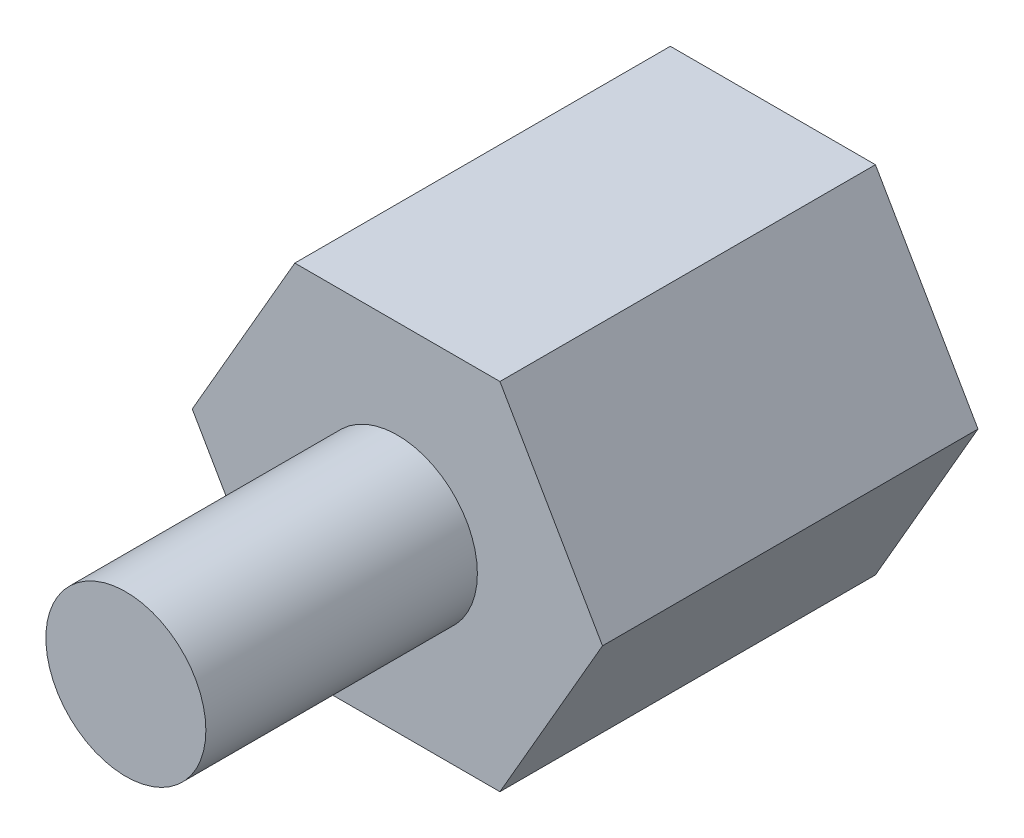
ISO-10303-21;
HEADER;
FILE_DESCRIPTION(('STEP AP214'),'2;1');
FILE_NAME('part.step','',(''),(''),'','','');
FILE_SCHEMA(('AUTOMOTIVE_DESIGN { 1 0 10303 214 1 1 1 1 }'));
ENDSEC;
DATA;
#1=APPLICATION_CONTEXT('core data for automotive mechanical design processes');
#2=APPLICATION_PROTOCOL_DEFINITION('international standard','automotive_design',2000,#1);
#3=PRODUCT_CONTEXT('',#1,'mechanical');
#4=PRODUCT('Part','Part','',(#3));
#5=PRODUCT_RELATED_PRODUCT_CATEGORY('part','',(#4));
#6=PRODUCT_DEFINITION_FORMATION('','',#4);
#7=PRODUCT_DEFINITION_CONTEXT('part definition',#1,'design');
#8=PRODUCT_DEFINITION('design','',#6,#7);
#9=PRODUCT_DEFINITION_SHAPE('','',#8);
#10=(LENGTH_UNIT() NAMED_UNIT(*) SI_UNIT(.MILLI.,.METRE.));
#11=(NAMED_UNIT(*) PLANE_ANGLE_UNIT() SI_UNIT($,.RADIAN.));
#12=(NAMED_UNIT(*) SI_UNIT($,.STERADIAN.) SOLID_ANGLE_UNIT());
#13=UNCERTAINTY_MEASURE_WITH_UNIT(LENGTH_MEASURE(1.E-05),#10,'distance_accuracy_value','');
#14=(GEOMETRIC_REPRESENTATION_CONTEXT(3) GLOBAL_UNCERTAINTY_ASSIGNED_CONTEXT((#13)) GLOBAL_UNIT_ASSIGNED_CONTEXT((#10,
#11,#12)) REPRESENTATION_CONTEXT('',''));
#15=CARTESIAN_POINT('',(0.,0.,0.));
#16=DIRECTION('',(0.,0.,1.));
#17=DIRECTION('',(1.,0.,0.));
#18=AXIS2_PLACEMENT_3D('',#15,#16,#17);
#19=CARTESIAN_POINT('',(0.,0.,6.5));
#20=DIRECTION('',(0.,0.,1.));
#21=DIRECTION('',(1.,0.,0.));
#22=AXIS2_PLACEMENT_3D('',#19,#20,#21);
#23=PLANE('',#22);
#24=DIRECTION('',(0.5,0.866025403784439,0.));
#25=VECTOR('',#24,1.);
#26=CARTESIAN_POINT('',(1.7753520777581,-3.075,6.5));
#27=LINE('',#26,#25);
#28=CARTESIAN_POINT('',(1.7753520777581,-3.075,6.5));
#29=VERTEX_POINT('',#28);
#30=CARTESIAN_POINT('',(3.5507041555162,0.,6.5));
#31=VERTEX_POINT('',#30);
#32=EDGE_CURVE('E160',#29,#31,#27,.T.);
#33=ORIENTED_EDGE('',*,*,#32,.T.);
#34=DIRECTION('',(-0.5,0.866025403784439,0.));
#35=VECTOR('',#34,1.);
#36=CARTESIAN_POINT('',(3.5507041555162,0.,6.5));
#37=LINE('',#36,#35);
#38=CARTESIAN_POINT('',(1.77535207775809,3.07500000000001,6.5));
#39=VERTEX_POINT('',#38);
#40=EDGE_CURVE('E106',#31,#39,#37,.T.);
#41=ORIENTED_EDGE('',*,*,#40,.T.);
#42=DIRECTION('',(-1.,0.,0.));
#43=VECTOR('',#42,1.);
#44=CARTESIAN_POINT('',(1.77535207775809,3.07500000000001,6.5));
#45=LINE('',#44,#43);
#46=CARTESIAN_POINT('',(-1.7753520777581,3.07500000000001,6.5));
#47=VERTEX_POINT('',#46);
#48=EDGE_CURVE('E121',#39,#47,#45,.T.);
#49=ORIENTED_EDGE('',*,*,#48,.T.);
#50=DIRECTION('',(-0.5,-0.866025403784439,0.));
#51=VECTOR('',#50,1.);
#52=CARTESIAN_POINT('',(-1.7753520777581,3.07500000000001,6.5));
#53=LINE('',#52,#51);
#54=CARTESIAN_POINT('',(-3.5507041555162,0.,6.5));
#55=VERTEX_POINT('',#54);
#56=EDGE_CURVE('E115',#47,#55,#53,.T.);
#57=ORIENTED_EDGE('',*,*,#56,.T.);
#58=DIRECTION('',(0.499999999999999,-0.866025403784439,0.));
#59=VECTOR('',#58,1.);
#60=CARTESIAN_POINT('',(-3.5507041555162,0.,6.5));
#61=LINE('',#60,#59);
#62=CARTESIAN_POINT('',(-1.7753520777581,-3.075,6.5));
#63=VERTEX_POINT('',#62);
#64=EDGE_CURVE('E119',#55,#63,#61,.T.);
#65=ORIENTED_EDGE('',*,*,#64,.T.);
#66=DIRECTION('',(1.,0.,0.));
#67=VECTOR('',#66,1.);
#68=CARTESIAN_POINT('',(-1.7753520777581,-3.075,6.5));
#69=LINE('',#68,#67);
#70=EDGE_CURVE('E61',#63,#29,#69,.T.);
#71=ORIENTED_EDGE('',*,*,#70,.T.);
#72=EDGE_LOOP('',(#33,#41,#49,#57,#65,#71));
#73=FACE_BOUND('',#72,.T.);
#74=CARTESIAN_POINT('',(0.,0.,6.5));
#75=DIRECTION('',(0.,0.,1.));
#76=DIRECTION('',(1.,0.,0.));
#77=AXIS2_PLACEMENT_3D('',#74,#75,#76);
#78=CIRCLE('',#77,1.385);
#79=CARTESIAN_POINT('',(1.385,0.,6.5));
#80=VERTEX_POINT('',#79);
#81=EDGE_CURVE('E216',#80,#80,#78,.T.);
#82=ORIENTED_EDGE('',*,*,#81,.F.);
#83=EDGE_LOOP('',(#82));
#84=FACE_BOUND('',#83,.T.);
#85=ADVANCED_FACE('F41',(#73,#84),#23,.T.);
#86=CARTESIAN_POINT('',(1.7753520777581,-3.075,6.5));
#87=DIRECTION('',(-0.866025403784439,0.5,0.));
#88=DIRECTION('',(-0.5,-0.866025403784439,0.));
#89=AXIS2_PLACEMENT_3D('',#86,#87,#88);
#90=PLANE('',#89);
#91=DIRECTION('',(0.5,0.866025403784439,0.));
#92=VECTOR('',#91,1.);
#93=CARTESIAN_POINT('',(1.7753520777581,-3.075,0.));
#94=LINE('',#93,#92);
#95=CARTESIAN_POINT('',(1.7753520777581,-3.075,0.));
#96=VERTEX_POINT('',#95);
#97=CARTESIAN_POINT('',(3.5507041555162,0.,0.));
#98=VERTEX_POINT('',#97);
#99=EDGE_CURVE('E144',#96,#98,#94,.T.);
#100=ORIENTED_EDGE('',*,*,#99,.T.);
#101=DIRECTION('',(0.,0.,-1.));
#102=VECTOR('',#101,1.);
#103=CARTESIAN_POINT('',(3.5507041555162,0.,6.5));
#104=LINE('',#103,#102);
#105=EDGE_CURVE('E11',#31,#98,#104,.T.);
#106=ORIENTED_EDGE('',*,*,#105,.F.);
#107=ORIENTED_EDGE('',*,*,#32,.F.);
#108=DIRECTION('',(0.,0.,-1.));
#109=VECTOR('',#108,1.);
#110=CARTESIAN_POINT('',(1.7753520777581,-3.075,6.5));
#111=LINE('',#110,#109);
#112=EDGE_CURVE('E140',#29,#96,#111,.T.);
#113=ORIENTED_EDGE('',*,*,#112,.T.);
#114=EDGE_LOOP('',(#100,#106,#107,#113));
#115=FACE_BOUND('',#114,.T.);
#116=ADVANCED_FACE('F43',(#115),#90,.F.);
#117=CARTESIAN_POINT('',(3.5507041555162,0.,6.5));
#118=DIRECTION('',(-0.866025403784439,-0.5,0.));
#119=DIRECTION('',(0.5,-0.866025403784439,0.));
#120=AXIS2_PLACEMENT_3D('',#117,#118,#119);
#121=PLANE('',#120);
#122=DIRECTION('',(-0.5,0.866025403784439,0.));
#123=VECTOR('',#122,1.);
#124=CARTESIAN_POINT('',(3.5507041555162,0.,0.));
#125=LINE('',#124,#123);
#126=CARTESIAN_POINT('',(1.77535207775809,3.07500000000001,0.));
#127=VERTEX_POINT('',#126);
#128=EDGE_CURVE('E147',#98,#127,#125,.T.);
#129=ORIENTED_EDGE('',*,*,#128,.T.);
#130=DIRECTION('',(0.,0.,-1.));
#131=VECTOR('',#130,1.);
#132=CARTESIAN_POINT('',(1.77535207775809,3.07500000000001,6.5));
#133=LINE('',#132,#131);
#134=EDGE_CURVE('E51',#39,#127,#133,.T.);
#135=ORIENTED_EDGE('',*,*,#134,.F.);
#136=ORIENTED_EDGE('',*,*,#40,.F.);
#137=ORIENTED_EDGE('',*,*,#105,.T.);
#138=EDGE_LOOP('',(#129,#135,#136,#137));
#139=FACE_BOUND('',#138,.T.);
#140=ADVANCED_FACE('F194',(#139),#121,.F.);
#141=CARTESIAN_POINT('',(1.77535207775809,3.07500000000001,6.5));
#142=DIRECTION('',(0.,-1.,0.));
#143=DIRECTION('',(1.,0.,0.));
#144=AXIS2_PLACEMENT_3D('',#141,#142,#143);
#145=PLANE('',#144);
#146=DIRECTION('',(-1.,0.,0.));
#147=VECTOR('',#146,1.);
#148=CARTESIAN_POINT('',(1.77535207775809,3.07500000000001,0.));
#149=LINE('',#148,#147);
#150=CARTESIAN_POINT('',(-1.7753520777581,3.07500000000001,0.));
#151=VERTEX_POINT('',#150);
#152=EDGE_CURVE('E151',#127,#151,#149,.T.);
#153=ORIENTED_EDGE('',*,*,#152,.T.);
#154=DIRECTION('',(0.,0.,-1.));
#155=VECTOR('',#154,1.);
#156=CARTESIAN_POINT('',(-1.7753520777581,3.07500000000001,6.5));
#157=LINE('',#156,#155);
#158=EDGE_CURVE('E132',#47,#151,#157,.T.);
#159=ORIENTED_EDGE('',*,*,#158,.F.);
#160=ORIENTED_EDGE('',*,*,#48,.F.);
#161=ORIENTED_EDGE('',*,*,#134,.T.);
#162=EDGE_LOOP('',(#153,#159,#160,#161));
#163=FACE_BOUND('',#162,.T.);
#164=ADVANCED_FACE('F171',(#163),#145,.F.);
#165=CARTESIAN_POINT('',(-1.7753520777581,3.07500000000001,6.5));
#166=DIRECTION('',(0.866025403784439,-0.5,0.));
#167=DIRECTION('',(0.5,0.866025403784439,0.));
#168=AXIS2_PLACEMENT_3D('',#165,#166,#167);
#169=PLANE('',#168);
#170=DIRECTION('',(-0.5,-0.866025403784439,0.));
#171=VECTOR('',#170,1.);
#172=CARTESIAN_POINT('',(-1.7753520777581,3.07500000000001,0.));
#173=LINE('',#172,#171);
#174=CARTESIAN_POINT('',(-3.5507041555162,0.,0.));
#175=VERTEX_POINT('',#174);
#176=EDGE_CURVE('E130',#151,#175,#173,.T.);
#177=ORIENTED_EDGE('',*,*,#176,.T.);
#178=DIRECTION('',(0.,0.,-1.));
#179=VECTOR('',#178,1.);
#180=CARTESIAN_POINT('',(-3.5507041555162,0.,6.5));
#181=LINE('',#180,#179);
#182=EDGE_CURVE('E127',#55,#175,#181,.T.);
#183=ORIENTED_EDGE('',*,*,#182,.F.);
#184=ORIENTED_EDGE('',*,*,#56,.F.);
#185=ORIENTED_EDGE('',*,*,#158,.T.);
#186=EDGE_LOOP('',(#177,#183,#184,#185));
#187=FACE_BOUND('',#186,.T.);
#188=ADVANCED_FACE('F128',(#187),#169,.F.);
#189=CARTESIAN_POINT('',(-3.5507041555162,0.,6.5));
#190=DIRECTION('',(0.866025403784439,0.499999999999999,0.));
#191=DIRECTION('',(-0.5,0.866025403784439,0.));
#192=AXIS2_PLACEMENT_3D('',#189,#190,#191);
#193=PLANE('',#192);
#194=DIRECTION('',(0.499999999999999,-0.866025403784439,0.));
#195=VECTOR('',#194,1.);
#196=CARTESIAN_POINT('',(-3.5507041555162,0.,0.));
#197=LINE('',#196,#195);
#198=CARTESIAN_POINT('',(-1.7753520777581,-3.075,0.));
#199=VERTEX_POINT('',#198);
#200=EDGE_CURVE('E90',#175,#199,#197,.T.);
#201=ORIENTED_EDGE('',*,*,#200,.T.);
#202=DIRECTION('',(0.,0.,-1.));
#203=VECTOR('',#202,1.);
#204=CARTESIAN_POINT('',(-1.7753520777581,-3.075,6.5));
#205=LINE('',#204,#203);
#206=EDGE_CURVE('E133',#63,#199,#205,.T.);
#207=ORIENTED_EDGE('',*,*,#206,.F.);
#208=ORIENTED_EDGE('',*,*,#64,.F.);
#209=ORIENTED_EDGE('',*,*,#182,.T.);
#210=EDGE_LOOP('',(#201,#207,#208,#209));
#211=FACE_BOUND('',#210,.T.);
#212=ADVANCED_FACE('F135',(#211),#193,.F.);
#213=CARTESIAN_POINT('',(-1.7753520777581,-3.075,6.5));
#214=DIRECTION('',(0.,1.,0.));
#215=DIRECTION('',(-1.,0.,0.));
#216=AXIS2_PLACEMENT_3D('',#213,#214,#215);
#217=PLANE('',#216);
#218=DIRECTION('',(1.,0.,0.));
#219=VECTOR('',#218,1.);
#220=CARTESIAN_POINT('',(-1.7753520777581,-3.075,0.));
#221=LINE('',#220,#219);
#222=EDGE_CURVE('E97',#199,#96,#221,.T.);
#223=ORIENTED_EDGE('',*,*,#222,.T.);
#224=ORIENTED_EDGE('',*,*,#112,.F.);
#225=ORIENTED_EDGE('',*,*,#70,.F.);
#226=ORIENTED_EDGE('',*,*,#206,.T.);
#227=EDGE_LOOP('',(#223,#224,#225,#226));
#228=FACE_BOUND('',#227,.T.);
#229=ADVANCED_FACE('F178',(#228),#217,.F.);
#230=CARTESIAN_POINT('',(0.,0.,0.));
#231=DIRECTION('',(0.,0.,1.));
#232=DIRECTION('',(1.,0.,0.));
#233=AXIS2_PLACEMENT_3D('',#230,#231,#232);
#234=PLANE('',#233);
#235=CARTESIAN_POINT('',(0.,0.,0.));
#236=DIRECTION('',(0.,0.,-1.));
#237=DIRECTION('',(-1.,0.,0.));
#238=AXIS2_PLACEMENT_3D('',#235,#236,#237);
#239=CIRCLE('',#238,1.35);
#240=CARTESIAN_POINT('',(-1.35,0.,0.));
#241=VERTEX_POINT('',#240);
#242=EDGE_CURVE('E217',#241,#241,#239,.T.);
#243=ORIENTED_EDGE('',*,*,#242,.F.);
#244=EDGE_LOOP('',(#243));
#245=FACE_BOUND('',#244,.T.);
#246=ORIENTED_EDGE('',*,*,#99,.F.);
#247=ORIENTED_EDGE('',*,*,#222,.F.);
#248=ORIENTED_EDGE('',*,*,#200,.F.);
#249=ORIENTED_EDGE('',*,*,#176,.F.);
#250=ORIENTED_EDGE('',*,*,#152,.F.);
#251=ORIENTED_EDGE('',*,*,#128,.F.);
#252=EDGE_LOOP('',(#246,#247,#248,#249,#250,#251));
#253=FACE_BOUND('',#252,.T.);
#254=ADVANCED_FACE('F174',(#245,#253),#234,.F.);
#255=CARTESIAN_POINT('',(0.,0.,11.2));
#256=DIRECTION('',(0.,0.,-1.));
#257=DIRECTION('',(-1.,0.,0.));
#258=AXIS2_PLACEMENT_3D('',#255,#256,#257);
#259=CYLINDRICAL_SURFACE('',#258,1.385);
#260=CARTESIAN_POINT('',(0.,0.,11.2));
#261=DIRECTION('',(0.,0.,1.));
#262=DIRECTION('',(1.,0.,0.));
#263=AXIS2_PLACEMENT_3D('',#260,#261,#262);
#264=CIRCLE('',#263,1.385);
#265=CARTESIAN_POINT('',(1.385,0.,11.2));
#266=VERTEX_POINT('',#265);
#267=EDGE_CURVE('E148',#266,#266,#264,.T.);
#268=ORIENTED_EDGE('',*,*,#267,.F.);
#269=EDGE_LOOP('',(#268));
#270=FACE_BOUND('',#269,.T.);
#271=ORIENTED_EDGE('',*,*,#81,.T.);
#272=EDGE_LOOP('',(#271));
#273=FACE_BOUND('',#272,.T.);
#274=ADVANCED_FACE('F185',(#270,#273),#259,.T.);
#275=CARTESIAN_POINT('',(0.,0.,11.2));
#276=DIRECTION('',(0.,0.,1.));
#277=DIRECTION('',(1.,0.,0.));
#278=AXIS2_PLACEMENT_3D('',#275,#276,#277);
#279=PLANE('',#278);
#280=ORIENTED_EDGE('',*,*,#267,.T.);
#281=EDGE_LOOP('',(#280));
#282=FACE_BOUND('',#281,.T.);
#283=ADVANCED_FACE('F198',(#282),#279,.T.);
#284=CARTESIAN_POINT('',(0.,0.,4.7));
#285=DIRECTION('',(0.,0.,-1.));
#286=DIRECTION('',(-1.,0.,0.));
#287=AXIS2_PLACEMENT_3D('',#284,#285,#286);
#288=CYLINDRICAL_SURFACE('',#287,1.35);
#289=CARTESIAN_POINT('',(0.,0.,4.7));
#290=DIRECTION('',(0.,0.,-1.));
#291=DIRECTION('',(-1.,0.,0.));
#292=AXIS2_PLACEMENT_3D('',#289,#290,#291);
#293=CIRCLE('',#292,1.35);
#294=CARTESIAN_POINT('',(-1.35,0.,4.7));
#295=VERTEX_POINT('',#294);
#296=EDGE_CURVE('E214',#295,#295,#293,.T.);
#297=ORIENTED_EDGE('',*,*,#296,.F.);
#298=EDGE_LOOP('',(#297));
#299=FACE_BOUND('',#298,.T.);
#300=ORIENTED_EDGE('',*,*,#242,.T.);
#301=EDGE_LOOP('',(#300));
#302=FACE_BOUND('',#301,.T.);
#303=ADVANCED_FACE('F202',(#299,#302),#288,.F.);
#304=CARTESIAN_POINT('',(0.,0.,4.7));
#305=DIRECTION('',(0.,0.,-1.));
#306=DIRECTION('',(-1.,0.,0.));
#307=AXIS2_PLACEMENT_3D('',#304,#305,#306);
#308=PLANE('',#307);
#309=ORIENTED_EDGE('',*,*,#296,.T.);
#310=EDGE_LOOP('',(#309));
#311=FACE_BOUND('',#310,.T.);
#312=ADVANCED_FACE('F206',(#311),#308,.T.);
#313=CLOSED_SHELL('',(#85,#116,#140,#164,#188,#212,#229,#254,#274,#283,#303,#312));
#314=MANIFOLD_SOLID_BREP('B2',#313);
#315=ADVANCED_BREP_SHAPE_REPRESENTATION('',(#18,#314),#14);
#316=SHAPE_DEFINITION_REPRESENTATION(#9,#315);
ENDSEC;
END-ISO-10303-21;
